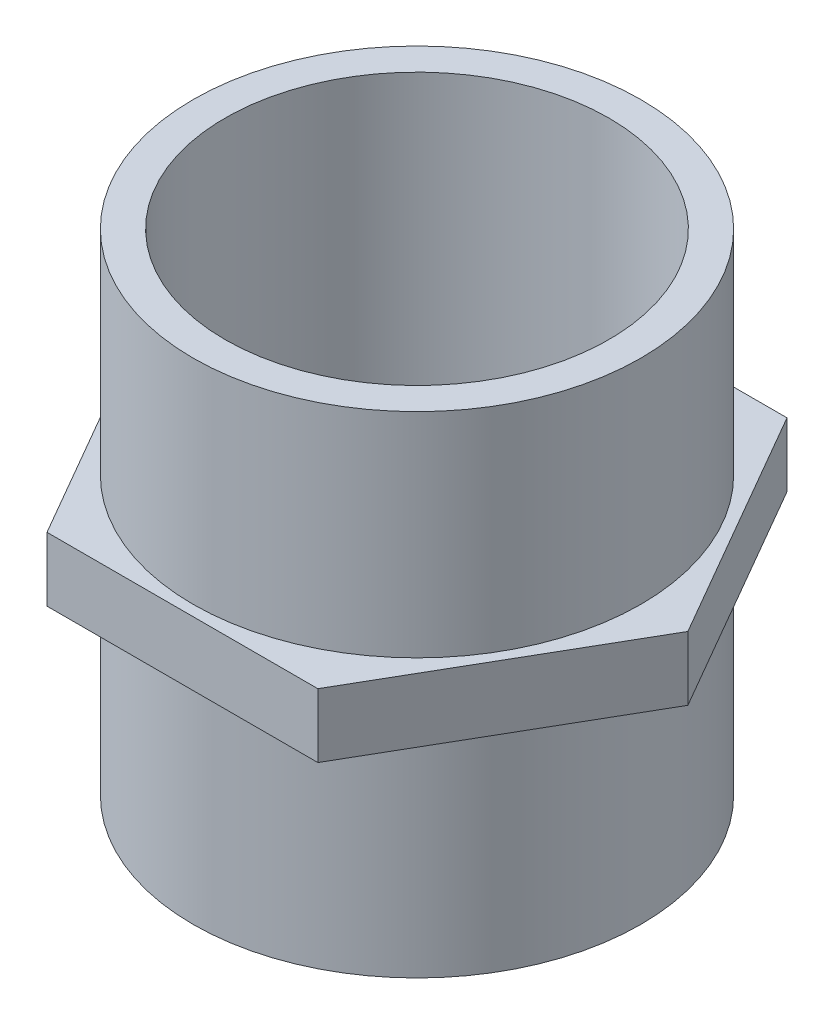
ISO-10303-21;
HEADER;
FILE_DESCRIPTION(('STEP AP214'),'2;1');
FILE_NAME('part.step','',(''),(''),'','','');
FILE_SCHEMA(('AUTOMOTIVE_DESIGN { 1 0 10303 214 1 1 1 1 }'));
ENDSEC;
DATA;
#1=APPLICATION_CONTEXT('core data for automotive mechanical design processes');
#2=APPLICATION_PROTOCOL_DEFINITION('international standard','automotive_design',2000,#1);
#3=PRODUCT_CONTEXT('',#1,'mechanical');
#4=PRODUCT('Part','Part','',(#3));
#5=PRODUCT_RELATED_PRODUCT_CATEGORY('part','',(#4));
#6=PRODUCT_DEFINITION_FORMATION('','',#4);
#7=PRODUCT_DEFINITION_CONTEXT('part definition',#1,'design');
#8=PRODUCT_DEFINITION('design','',#6,#7);
#9=PRODUCT_DEFINITION_SHAPE('','',#8);
#10=(LENGTH_UNIT() NAMED_UNIT(*) SI_UNIT(.MILLI.,.METRE.));
#11=(NAMED_UNIT(*) PLANE_ANGLE_UNIT() SI_UNIT($,.RADIAN.));
#12=(NAMED_UNIT(*) SI_UNIT($,.STERADIAN.) SOLID_ANGLE_UNIT());
#13=UNCERTAINTY_MEASURE_WITH_UNIT(LENGTH_MEASURE(1.E-05),#10,'distance_accuracy_value','');
#14=(GEOMETRIC_REPRESENTATION_CONTEXT(3) GLOBAL_UNCERTAINTY_ASSIGNED_CONTEXT((#13)) GLOBAL_UNIT_ASSIGNED_CONTEXT((#10,
#11,#12)) REPRESENTATION_CONTEXT('',''));
#15=CARTESIAN_POINT('',(0.,0.,0.));
#16=DIRECTION('',(0.,0.,1.));
#17=DIRECTION('',(1.,0.,0.));
#18=AXIS2_PLACEMENT_3D('',#15,#16,#17);
#19=CARTESIAN_POINT('',(-6.35085296108587,1.5,11.));
#20=DIRECTION('',(0.,0.,-1.));
#21=DIRECTION('',(-1.,0.,0.));
#22=AXIS2_PLACEMENT_3D('',#19,#20,#21);
#23=PLANE('',#22);
#24=DIRECTION('',(1.,0.,0.));
#25=VECTOR('',#24,1.);
#26=CARTESIAN_POINT('',(-6.35085296108587,-1.5,11.));
#27=LINE('',#26,#25);
#28=CARTESIAN_POINT('',(-6.35085296108587,-1.5,11.));
#29=VERTEX_POINT('',#28);
#30=CARTESIAN_POINT('',(6.35085296108589,-1.5,11.));
#31=VERTEX_POINT('',#30);
#32=EDGE_CURVE('E119',#29,#31,#27,.T.);
#33=ORIENTED_EDGE('',*,*,#32,.T.);
#34=DIRECTION('',(0.,-1.,0.));
#35=VECTOR('',#34,1.);
#36=CARTESIAN_POINT('',(6.35085296108589,1.5,11.));
#37=LINE('',#36,#35);
#38=CARTESIAN_POINT('',(6.35085296108589,1.5,11.));
#39=VERTEX_POINT('',#38);
#40=EDGE_CURVE('E36',#39,#31,#37,.T.);
#41=ORIENTED_EDGE('',*,*,#40,.F.);
#42=DIRECTION('',(1.,0.,0.));
#43=VECTOR('',#42,1.);
#44=CARTESIAN_POINT('',(-6.35085296108587,1.5,11.));
#45=LINE('',#44,#43);
#46=CARTESIAN_POINT('',(-6.35085296108587,1.5,11.));
#47=VERTEX_POINT('',#46);
#48=EDGE_CURVE('E130',#47,#39,#45,.T.);
#49=ORIENTED_EDGE('',*,*,#48,.F.);
#50=DIRECTION('',(0.,-1.,0.));
#51=VECTOR('',#50,1.);
#52=CARTESIAN_POINT('',(-6.35085296108587,1.5,11.));
#53=LINE('',#52,#51);
#54=EDGE_CURVE('E115',#47,#29,#53,.T.);
#55=ORIENTED_EDGE('',*,*,#54,.T.);
#56=EDGE_LOOP('',(#33,#41,#49,#55));
#57=FACE_BOUND('',#56,.T.);
#58=ADVANCED_FACE('F33',(#57),#23,.F.);
#59=CARTESIAN_POINT('',(6.35085296108589,1.5,11.));
#60=DIRECTION('',(-0.866025403784439,0.,-0.5));
#61=DIRECTION('',(-0.5,0.,0.866025403784439));
#62=AXIS2_PLACEMENT_3D('',#59,#60,#61);
#63=PLANE('',#62);
#64=DIRECTION('',(0.5,0.,-0.866025403784439));
#65=VECTOR('',#64,1.);
#66=CARTESIAN_POINT('',(6.35085296108589,-1.5,11.));
#67=LINE('',#66,#65);
#68=CARTESIAN_POINT('',(12.7017059221718,-1.5,0.));
#69=VERTEX_POINT('',#68);
#70=EDGE_CURVE('E122',#31,#69,#67,.T.);
#71=ORIENTED_EDGE('',*,*,#70,.T.);
#72=DIRECTION('',(0.,-1.,0.));
#73=VECTOR('',#72,1.);
#74=CARTESIAN_POINT('',(12.7017059221718,1.5,0.));
#75=LINE('',#74,#73);
#76=CARTESIAN_POINT('',(12.7017059221718,1.5,0.));
#77=VERTEX_POINT('',#76);
#78=EDGE_CURVE('E133',#77,#69,#75,.T.);
#79=ORIENTED_EDGE('',*,*,#78,.F.);
#80=DIRECTION('',(0.5,0.,-0.866025403784439));
#81=VECTOR('',#80,1.);
#82=CARTESIAN_POINT('',(6.35085296108589,1.5,11.));
#83=LINE('',#82,#81);
#84=EDGE_CURVE('E88',#39,#77,#83,.T.);
#85=ORIENTED_EDGE('',*,*,#84,.F.);
#86=ORIENTED_EDGE('',*,*,#40,.T.);
#87=EDGE_LOOP('',(#71,#79,#85,#86));
#88=FACE_BOUND('',#87,.T.);
#89=ADVANCED_FACE('F138',(#88),#63,.F.);
#90=CARTESIAN_POINT('',(12.7017059221718,1.5,0.));
#91=DIRECTION('',(-0.866025403784438,0.,0.500000000000001));
#92=DIRECTION('',(0.500000000000001,0.,0.866025403784438));
#93=AXIS2_PLACEMENT_3D('',#90,#91,#92);
#94=PLANE('',#93);
#95=DIRECTION('',(-0.5,0.,-0.866025403784438));
#96=VECTOR('',#95,1.);
#97=CARTESIAN_POINT('',(12.7017059221718,-1.5,0.));
#98=LINE('',#97,#96);
#99=CARTESIAN_POINT('',(6.35085296108588,-1.5,-11.));
#100=VERTEX_POINT('',#99);
#101=EDGE_CURVE('E125',#69,#100,#98,.T.);
#102=ORIENTED_EDGE('',*,*,#101,.T.);
#103=DIRECTION('',(0.,-1.,0.));
#104=VECTOR('',#103,1.);
#105=CARTESIAN_POINT('',(6.35085296108588,1.5,-11.));
#106=LINE('',#105,#104);
#107=CARTESIAN_POINT('',(6.35085296108588,1.5,-11.));
#108=VERTEX_POINT('',#107);
#109=EDGE_CURVE('E110',#108,#100,#106,.T.);
#110=ORIENTED_EDGE('',*,*,#109,.F.);
#111=DIRECTION('',(-0.5,0.,-0.866025403784438));
#112=VECTOR('',#111,1.);
#113=CARTESIAN_POINT('',(12.7017059221718,1.5,0.));
#114=LINE('',#113,#112);
#115=EDGE_CURVE('E101',#77,#108,#114,.T.);
#116=ORIENTED_EDGE('',*,*,#115,.F.);
#117=ORIENTED_EDGE('',*,*,#78,.T.);
#118=EDGE_LOOP('',(#102,#110,#116,#117));
#119=FACE_BOUND('',#118,.T.);
#120=ADVANCED_FACE('F144',(#119),#94,.F.);
#121=CARTESIAN_POINT('',(6.35085296108588,1.5,-11.));
#122=DIRECTION('',(0.,0.,1.));
#123=DIRECTION('',(1.,0.,0.));
#124=AXIS2_PLACEMENT_3D('',#121,#122,#123);
#125=PLANE('',#124);
#126=DIRECTION('',(-1.,0.,0.));
#127=VECTOR('',#126,1.);
#128=CARTESIAN_POINT('',(6.35085296108588,-1.5,-11.));
#129=LINE('',#128,#127);
#130=CARTESIAN_POINT('',(-6.35085296108588,-1.5,-11.));
#131=VERTEX_POINT('',#130);
#132=EDGE_CURVE('E109',#100,#131,#129,.T.);
#133=ORIENTED_EDGE('',*,*,#132,.T.);
#134=DIRECTION('',(0.,-1.,0.));
#135=VECTOR('',#134,1.);
#136=CARTESIAN_POINT('',(-6.35085296108588,1.5,-11.));
#137=LINE('',#136,#135);
#138=CARTESIAN_POINT('',(-6.35085296108588,1.5,-11.));
#139=VERTEX_POINT('',#138);
#140=EDGE_CURVE('E106',#139,#131,#137,.T.);
#141=ORIENTED_EDGE('',*,*,#140,.F.);
#142=DIRECTION('',(-1.,0.,0.));
#143=VECTOR('',#142,1.);
#144=CARTESIAN_POINT('',(6.35085296108588,1.5,-11.));
#145=LINE('',#144,#143);
#146=EDGE_CURVE('E95',#108,#139,#145,.T.);
#147=ORIENTED_EDGE('',*,*,#146,.F.);
#148=ORIENTED_EDGE('',*,*,#109,.T.);
#149=EDGE_LOOP('',(#133,#141,#147,#148));
#150=FACE_BOUND('',#149,.T.);
#151=ADVANCED_FACE('F107',(#150),#125,.F.);
#152=CARTESIAN_POINT('',(-6.35085296108588,1.5,-11.));
#153=DIRECTION('',(0.866025403784439,0.,0.5));
#154=DIRECTION('',(0.5,0.,-0.866025403784439));
#155=AXIS2_PLACEMENT_3D('',#152,#153,#154);
#156=PLANE('',#155);
#157=DIRECTION('',(-0.5,0.,0.866025403784439));
#158=VECTOR('',#157,1.);
#159=CARTESIAN_POINT('',(-6.35085296108588,-1.5,-11.));
#160=LINE('',#159,#158);
#161=CARTESIAN_POINT('',(-12.7017059221718,-1.5,0.));
#162=VERTEX_POINT('',#161);
#163=EDGE_CURVE('E73',#131,#162,#160,.T.);
#164=ORIENTED_EDGE('',*,*,#163,.T.);
#165=DIRECTION('',(0.,-1.,0.));
#166=VECTOR('',#165,1.);
#167=CARTESIAN_POINT('',(-12.7017059221718,1.5,0.));
#168=LINE('',#167,#166);
#169=CARTESIAN_POINT('',(-12.7017059221718,1.5,0.));
#170=VERTEX_POINT('',#169);
#171=EDGE_CURVE('E111',#170,#162,#168,.T.);
#172=ORIENTED_EDGE('',*,*,#171,.F.);
#173=DIRECTION('',(-0.5,0.,0.866025403784439));
#174=VECTOR('',#173,1.);
#175=CARTESIAN_POINT('',(-6.35085296108588,1.5,-11.));
#176=LINE('',#175,#174);
#177=EDGE_CURVE('E99',#139,#170,#176,.T.);
#178=ORIENTED_EDGE('',*,*,#177,.F.);
#179=ORIENTED_EDGE('',*,*,#140,.T.);
#180=EDGE_LOOP('',(#164,#172,#178,#179));
#181=FACE_BOUND('',#180,.T.);
#182=ADVANCED_FACE('F113',(#181),#156,.F.);
#183=CARTESIAN_POINT('',(-12.7017059221718,1.5,0.));
#184=DIRECTION('',(0.866025403784438,0.,-0.5));
#185=DIRECTION('',(-0.5,0.,-0.866025403784439));
#186=AXIS2_PLACEMENT_3D('',#183,#184,#185);
#187=PLANE('',#186);
#188=DIRECTION('',(0.5,0.,0.866025403784438));
#189=VECTOR('',#188,1.);
#190=CARTESIAN_POINT('',(-12.7017059221718,-1.5,0.));
#191=LINE('',#190,#189);
#192=EDGE_CURVE('E79',#162,#29,#191,.T.);
#193=ORIENTED_EDGE('',*,*,#192,.T.);
#194=ORIENTED_EDGE('',*,*,#54,.F.);
#195=DIRECTION('',(0.5,0.,0.866025403784438));
#196=VECTOR('',#195,1.);
#197=CARTESIAN_POINT('',(-12.7017059221718,1.5,0.));
#198=LINE('',#197,#196);
#199=EDGE_CURVE('E50',#170,#47,#198,.T.);
#200=ORIENTED_EDGE('',*,*,#199,.F.);
#201=ORIENTED_EDGE('',*,*,#171,.T.);
#202=EDGE_LOOP('',(#193,#194,#200,#201));
#203=FACE_BOUND('',#202,.T.);
#204=ADVANCED_FACE('F186',(#203),#187,.F.);
#205=CARTESIAN_POINT('',(0.,1.5,0.));
#206=DIRECTION('',(0.,1.,0.));
#207=DIRECTION('',(0.,0.,1.));
#208=AXIS2_PLACEMENT_3D('',#205,#206,#207);
#209=PLANE('',#208);
#210=CARTESIAN_POINT('',(0.,1.5,0.));
#211=DIRECTION('',(0.,1.,0.));
#212=DIRECTION('',(0.,0.,1.));
#213=AXIS2_PLACEMENT_3D('',#210,#211,#212);
#214=CIRCLE('',#213,10.5);
#215=CARTESIAN_POINT('',(0.,1.5,10.5));
#216=VERTEX_POINT('',#215);
#217=EDGE_CURVE('E11',#216,#216,#214,.T.);
#218=ORIENTED_EDGE('',*,*,#217,.F.);
#219=EDGE_LOOP('',(#218));
#220=FACE_BOUND('',#219,.T.);
#221=ORIENTED_EDGE('',*,*,#48,.T.);
#222=ORIENTED_EDGE('',*,*,#84,.T.);
#223=ORIENTED_EDGE('',*,*,#115,.T.);
#224=ORIENTED_EDGE('',*,*,#146,.T.);
#225=ORIENTED_EDGE('',*,*,#177,.T.);
#226=ORIENTED_EDGE('',*,*,#199,.T.);
#227=EDGE_LOOP('',(#221,#222,#223,#224,#225,#226));
#228=FACE_BOUND('',#227,.T.);
#229=ADVANCED_FACE('F97',(#220,#228),#209,.T.);
#230=CARTESIAN_POINT('',(0.,-1.5,0.));
#231=DIRECTION('',(0.,1.,0.));
#232=DIRECTION('',(0.,0.,1.));
#233=AXIS2_PLACEMENT_3D('',#230,#231,#232);
#234=PLANE('',#233);
#235=CARTESIAN_POINT('',(0.,-1.5,0.));
#236=DIRECTION('',(0.,1.,0.));
#237=DIRECTION('',(0.,0.,1.));
#238=AXIS2_PLACEMENT_3D('',#235,#236,#237);
#239=CIRCLE('',#238,10.5);
#240=CARTESIAN_POINT('',(0.,-1.5,10.5));
#241=VERTEX_POINT('',#240);
#242=EDGE_CURVE('E151',#241,#241,#239,.T.);
#243=ORIENTED_EDGE('',*,*,#242,.T.);
#244=EDGE_LOOP('',(#243));
#245=FACE_BOUND('',#244,.T.);
#246=ORIENTED_EDGE('',*,*,#32,.F.);
#247=ORIENTED_EDGE('',*,*,#192,.F.);
#248=ORIENTED_EDGE('',*,*,#163,.F.);
#249=ORIENTED_EDGE('',*,*,#132,.F.);
#250=ORIENTED_EDGE('',*,*,#101,.F.);
#251=ORIENTED_EDGE('',*,*,#70,.F.);
#252=EDGE_LOOP('',(#246,#247,#248,#249,#250,#251));
#253=FACE_BOUND('',#252,.T.);
#254=ADVANCED_FACE('F143',(#245,#253),#234,.F.);
#255=CARTESIAN_POINT('',(0.,11.5,0.));
#256=DIRECTION('',(0.,-1.,0.));
#257=DIRECTION('',(0.,0.,-1.));
#258=AXIS2_PLACEMENT_3D('',#255,#256,#257);
#259=CYLINDRICAL_SURFACE('',#258,10.5);
#260=CARTESIAN_POINT('',(0.,11.5,0.));
#261=DIRECTION('',(0.,1.,0.));
#262=DIRECTION('',(0.,0.,1.));
#263=AXIS2_PLACEMENT_3D('',#260,#261,#262);
#264=CIRCLE('',#263,10.5);
#265=CARTESIAN_POINT('',(0.,11.5,10.5));
#266=VERTEX_POINT('',#265);
#267=EDGE_CURVE('E123',#266,#266,#264,.T.);
#268=ORIENTED_EDGE('',*,*,#267,.F.);
#269=EDGE_LOOP('',(#268));
#270=FACE_BOUND('',#269,.T.);
#271=ORIENTED_EDGE('',*,*,#217,.T.);
#272=EDGE_LOOP('',(#271));
#273=FACE_BOUND('',#272,.T.);
#274=ADVANCED_FACE('F176',(#270,#273),#259,.T.);
#275=CARTESIAN_POINT('',(0.,11.5,0.));
#276=DIRECTION('',(0.,1.,0.));
#277=DIRECTION('',(0.,0.,1.));
#278=AXIS2_PLACEMENT_3D('',#275,#276,#277);
#279=PLANE('',#278);
#280=CARTESIAN_POINT('',(0.,11.5,0.));
#281=DIRECTION('',(0.,1.,0.));
#282=DIRECTION('',(0.,0.,1.));
#283=AXIS2_PLACEMENT_3D('',#280,#281,#282);
#284=CIRCLE('',#283,9.);
#285=CARTESIAN_POINT('',(0.,11.5,9.));
#286=VERTEX_POINT('',#285);
#287=EDGE_CURVE('E157',#286,#286,#284,.T.);
#288=ORIENTED_EDGE('',*,*,#287,.F.);
#289=EDGE_LOOP('',(#288));
#290=FACE_BOUND('',#289,.T.);
#291=ORIENTED_EDGE('',*,*,#267,.T.);
#292=EDGE_LOOP('',(#291));
#293=FACE_BOUND('',#292,.T.);
#294=ADVANCED_FACE('F172',(#290,#293),#279,.T.);
#295=CARTESIAN_POINT('',(0.,-11.5,0.));
#296=DIRECTION('',(0.,1.,0.));
#297=DIRECTION('',(0.,0.,1.));
#298=AXIS2_PLACEMENT_3D('',#295,#296,#297);
#299=CYLINDRICAL_SURFACE('',#298,10.5);
#300=CARTESIAN_POINT('',(0.,-11.5,0.));
#301=DIRECTION('',(0.,1.,0.));
#302=DIRECTION('',(0.,0.,1.));
#303=AXIS2_PLACEMENT_3D('',#300,#301,#302);
#304=CIRCLE('',#303,10.5);
#305=CARTESIAN_POINT('',(0.,-11.5,10.5));
#306=VERTEX_POINT('',#305);
#307=EDGE_CURVE('E150',#306,#306,#304,.T.);
#308=ORIENTED_EDGE('',*,*,#307,.T.);
#309=EDGE_LOOP('',(#308));
#310=FACE_BOUND('',#309,.T.);
#311=ORIENTED_EDGE('',*,*,#242,.F.);
#312=EDGE_LOOP('',(#311));
#313=FACE_BOUND('',#312,.T.);
#314=ADVANCED_FACE('F175',(#310,#313),#299,.T.);
#315=CARTESIAN_POINT('',(0.,-11.5,0.));
#316=DIRECTION('',(0.,-1.,0.));
#317=DIRECTION('',(0.,0.,1.));
#318=AXIS2_PLACEMENT_3D('',#315,#316,#317);
#319=PLANE('',#318);
#320=CARTESIAN_POINT('',(0.,-11.5,0.));
#321=DIRECTION('',(0.,1.,0.));
#322=DIRECTION('',(0.,0.,1.));
#323=AXIS2_PLACEMENT_3D('',#320,#321,#322);
#324=CIRCLE('',#323,9.);
#325=CARTESIAN_POINT('',(0.,-11.5,9.));
#326=VERTEX_POINT('',#325);
#327=EDGE_CURVE('E154',#326,#326,#324,.T.);
#328=ORIENTED_EDGE('',*,*,#327,.T.);
#329=EDGE_LOOP('',(#328));
#330=FACE_BOUND('',#329,.T.);
#331=ORIENTED_EDGE('',*,*,#307,.F.);
#332=EDGE_LOOP('',(#331));
#333=FACE_BOUND('',#332,.T.);
#334=ADVANCED_FACE('F163',(#330,#333),#319,.T.);
#335=CARTESIAN_POINT('',(0.,-11.5,0.));
#336=DIRECTION('',(0.,1.,0.));
#337=DIRECTION('',(0.,0.,1.));
#338=AXIS2_PLACEMENT_3D('',#335,#336,#337);
#339=CYLINDRICAL_SURFACE('',#338,9.);
#340=ORIENTED_EDGE('',*,*,#327,.F.);
#341=EDGE_LOOP('',(#340));
#342=FACE_BOUND('',#341,.T.);
#343=ORIENTED_EDGE('',*,*,#287,.T.);
#344=EDGE_LOOP('',(#343));
#345=FACE_BOUND('',#344,.T.);
#346=ADVANCED_FACE('F166',(#342,#345),#339,.F.);
#347=CLOSED_SHELL('',(#58,#89,#120,#151,#182,#204,#229,#254,#274,#294,#314,#334,#346));
#348=MANIFOLD_SOLID_BREP('B2',#347);
#349=ADVANCED_BREP_SHAPE_REPRESENTATION('',(#18,#348),#14);
#350=SHAPE_DEFINITION_REPRESENTATION(#9,#349);
ENDSEC;
END-ISO-10303-21;
